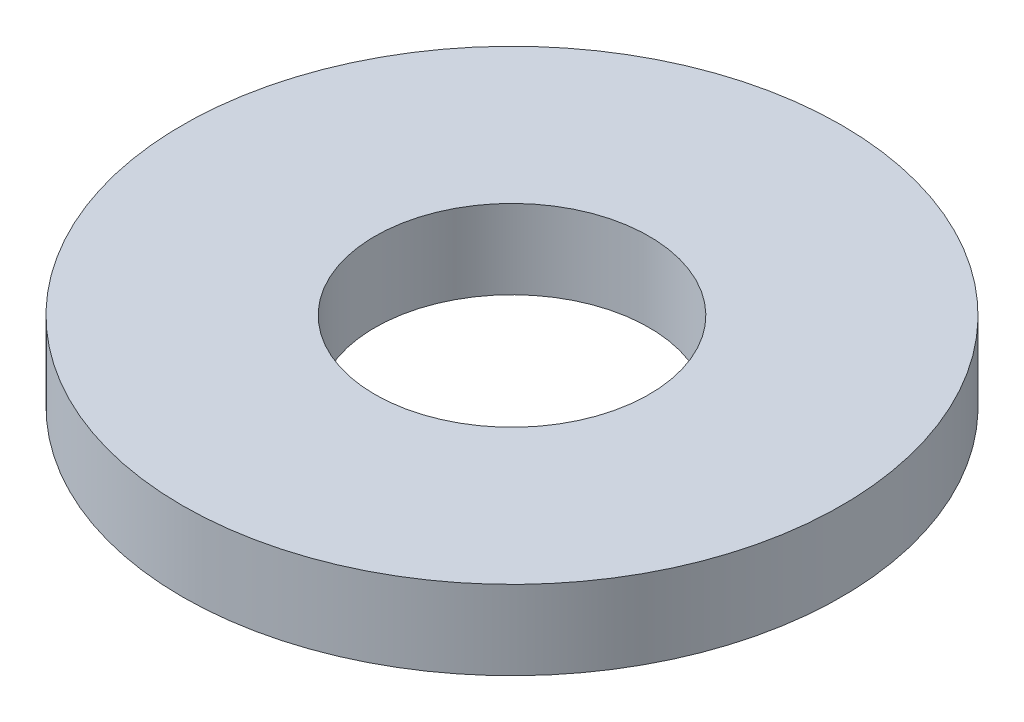
ISO-10303-21;
HEADER;
FILE_DESCRIPTION(('STEP AP214'),'2;1');
FILE_NAME('part.step','',(''),(''),'','','');
FILE_SCHEMA(('AUTOMOTIVE_DESIGN { 1 0 10303 214 1 1 1 1 }'));
ENDSEC;
DATA;
#1=APPLICATION_CONTEXT('core data for automotive mechanical design processes');
#2=APPLICATION_PROTOCOL_DEFINITION('international standard','automotive_design',2000,#1);
#3=PRODUCT_CONTEXT('',#1,'mechanical');
#4=PRODUCT('Part','Part','',(#3));
#5=PRODUCT_RELATED_PRODUCT_CATEGORY('part','',(#4));
#6=PRODUCT_DEFINITION_FORMATION('','',#4);
#7=PRODUCT_DEFINITION_CONTEXT('part definition',#1,'design');
#8=PRODUCT_DEFINITION('design','',#6,#7);
#9=PRODUCT_DEFINITION_SHAPE('','',#8);
#10=(LENGTH_UNIT() NAMED_UNIT(*) SI_UNIT(.MILLI.,.METRE.));
#11=(NAMED_UNIT(*) PLANE_ANGLE_UNIT() SI_UNIT($,.RADIAN.));
#12=(NAMED_UNIT(*) SI_UNIT($,.STERADIAN.) SOLID_ANGLE_UNIT());
#13=UNCERTAINTY_MEASURE_WITH_UNIT(LENGTH_MEASURE(1.E-05),#10,'distance_accuracy_value','');
#14=(GEOMETRIC_REPRESENTATION_CONTEXT(3) GLOBAL_UNCERTAINTY_ASSIGNED_CONTEXT((#13)) GLOBAL_UNIT_ASSIGNED_CONTEXT((#10,
#11,#12)) REPRESENTATION_CONTEXT('',''));
#15=CARTESIAN_POINT('',(0.,0.,0.));
#16=DIRECTION('',(0.,0.,1.));
#17=DIRECTION('',(1.,0.,0.));
#18=AXIS2_PLACEMENT_3D('',#15,#16,#17);
#19=CARTESIAN_POINT('',(0.,1.143,0.));
#20=DIRECTION('',(0.,-1.,0.));
#21=DIRECTION('',(0.,0.,-1.));
#22=AXIS2_PLACEMENT_3D('',#19,#20,#21);
#23=CYLINDRICAL_SURFACE('',#22,4.7625);
#24=CARTESIAN_POINT('',(0.,1.143,0.));
#25=DIRECTION('',(0.,1.,0.));
#26=DIRECTION('',(0.,0.,1.));
#27=AXIS2_PLACEMENT_3D('',#24,#25,#26);
#28=CIRCLE('',#27,4.7625);
#29=CARTESIAN_POINT('',(0.,1.143,4.7625));
#30=VERTEX_POINT('',#29);
#31=EDGE_CURVE('E10',#30,#30,#28,.T.);
#32=ORIENTED_EDGE('',*,*,#31,.F.);
#33=EDGE_LOOP('',(#32));
#34=FACE_BOUND('',#33,.T.);
#35=CARTESIAN_POINT('',(0.,0.,0.));
#36=DIRECTION('',(0.,1.,0.));
#37=DIRECTION('',(0.,0.,1.));
#38=AXIS2_PLACEMENT_3D('',#35,#36,#37);
#39=CIRCLE('',#38,4.7625);
#40=CARTESIAN_POINT('',(0.,0.,4.7625));
#41=VERTEX_POINT('',#40);
#42=EDGE_CURVE('E33',#41,#41,#39,.T.);
#43=ORIENTED_EDGE('',*,*,#42,.T.);
#44=EDGE_LOOP('',(#43));
#45=FACE_BOUND('',#44,.T.);
#46=ADVANCED_FACE('F30',(#34,#45),#23,.T.);
#47=CARTESIAN_POINT('',(0.,1.143,0.));
#48=DIRECTION('',(0.,1.,0.));
#49=DIRECTION('',(0.,0.,1.));
#50=AXIS2_PLACEMENT_3D('',#47,#48,#49);
#51=PLANE('',#50);
#52=CARTESIAN_POINT('',(0.,1.143,0.));
#53=DIRECTION('',(0.,1.,0.));
#54=DIRECTION('',(0.,0.,1.));
#55=AXIS2_PLACEMENT_3D('',#52,#53,#54);
#56=CIRCLE('',#55,1.9812);
#57=CARTESIAN_POINT('',(0.,1.143,1.9812));
#58=VERTEX_POINT('',#57);
#59=EDGE_CURVE('E42',#58,#58,#56,.T.);
#60=ORIENTED_EDGE('',*,*,#59,.F.);
#61=EDGE_LOOP('',(#60));
#62=FACE_BOUND('',#61,.T.);
#63=ORIENTED_EDGE('',*,*,#31,.T.);
#64=EDGE_LOOP('',(#63));
#65=FACE_BOUND('',#64,.T.);
#66=ADVANCED_FACE('F57',(#62,#65),#51,.T.);
#67=CARTESIAN_POINT('',(0.,0.,0.));
#68=DIRECTION('',(0.,1.,0.));
#69=DIRECTION('',(0.,0.,1.));
#70=AXIS2_PLACEMENT_3D('',#67,#68,#69);
#71=PLANE('',#70);
#72=CARTESIAN_POINT('',(0.,0.,0.));
#73=DIRECTION('',(0.,1.,0.));
#74=DIRECTION('',(0.,0.,1.));
#75=AXIS2_PLACEMENT_3D('',#72,#73,#74);
#76=CIRCLE('',#75,1.9812);
#77=CARTESIAN_POINT('',(0.,0.,1.9812));
#78=VERTEX_POINT('',#77);
#79=EDGE_CURVE('E40',#78,#78,#76,.T.);
#80=ORIENTED_EDGE('',*,*,#79,.T.);
#81=EDGE_LOOP('',(#80));
#82=FACE_BOUND('',#81,.T.);
#83=ORIENTED_EDGE('',*,*,#42,.F.);
#84=EDGE_LOOP('',(#83));
#85=FACE_BOUND('',#84,.T.);
#86=ADVANCED_FACE('F48',(#82,#85),#71,.F.);
#87=CARTESIAN_POINT('',(0.,0.,0.));
#88=DIRECTION('',(0.,1.,0.));
#89=DIRECTION('',(0.,0.,1.));
#90=AXIS2_PLACEMENT_3D('',#87,#88,#89);
#91=CYLINDRICAL_SURFACE('',#90,1.9812);
#92=ORIENTED_EDGE('',*,*,#79,.F.);
#93=EDGE_LOOP('',(#92));
#94=FACE_BOUND('',#93,.T.);
#95=ORIENTED_EDGE('',*,*,#59,.T.);
#96=EDGE_LOOP('',(#95));
#97=FACE_BOUND('',#96,.T.);
#98=ADVANCED_FACE('F51',(#94,#97),#91,.F.);
#99=CLOSED_SHELL('',(#46,#66,#86,#98));
#100=MANIFOLD_SOLID_BREP('B2',#99);
#101=ADVANCED_BREP_SHAPE_REPRESENTATION('',(#18,#100),#14);
#102=SHAPE_DEFINITION_REPRESENTATION(#9,#101);
ENDSEC;
END-ISO-10303-21;
